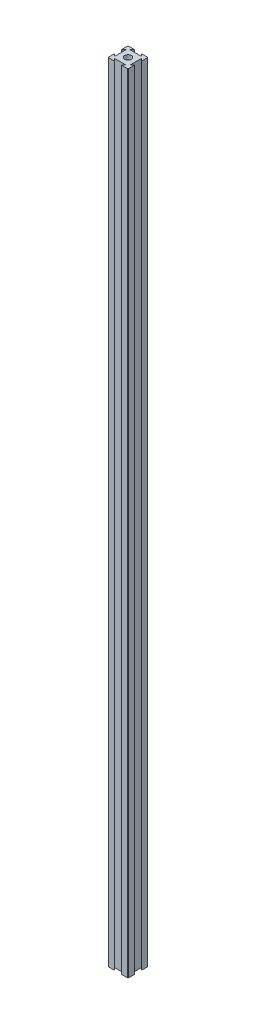
ISO-10303-21;
HEADER;
FILE_DESCRIPTION(('STEP AP214'),'2;1');
FILE_NAME('part.step','',(''),(''),'','','');
FILE_SCHEMA(('AUTOMOTIVE_DESIGN { 1 0 10303 214 1 1 1 1 }'));
ENDSEC;
DATA;
#1=APPLICATION_CONTEXT('core data for automotive mechanical design processes');
#2=APPLICATION_PROTOCOL_DEFINITION('international standard','automotive_design',2000,#1);
#3=PRODUCT_CONTEXT('',#1,'mechanical');
#4=PRODUCT('Part','Part','',(#3));
#5=PRODUCT_RELATED_PRODUCT_CATEGORY('part','',(#4));
#6=PRODUCT_DEFINITION_FORMATION('','',#4);
#7=PRODUCT_DEFINITION_CONTEXT('part definition',#1,'design');
#8=PRODUCT_DEFINITION('design','',#6,#7);
#9=PRODUCT_DEFINITION_SHAPE('','',#8);
#10=(LENGTH_UNIT() NAMED_UNIT(*) SI_UNIT(.MILLI.,.METRE.));
#11=(NAMED_UNIT(*) PLANE_ANGLE_UNIT() SI_UNIT($,.RADIAN.));
#12=(NAMED_UNIT(*) SI_UNIT($,.STERADIAN.) SOLID_ANGLE_UNIT());
#13=UNCERTAINTY_MEASURE_WITH_UNIT(LENGTH_MEASURE(1.E-05),#10,'distance_accuracy_value','');
#14=(GEOMETRIC_REPRESENTATION_CONTEXT(3) GLOBAL_UNCERTAINTY_ASSIGNED_CONTEXT((#13)) GLOBAL_UNIT_ASSIGNED_CONTEXT((#10,
#11,#12)) REPRESENTATION_CONTEXT('',''));
#15=CARTESIAN_POINT('',(0.,0.,0.));
#16=DIRECTION('',(0.,0.,1.));
#17=DIRECTION('',(1.,0.,0.));
#18=AXIS2_PLACEMENT_3D('',#15,#16,#17);
#19=CARTESIAN_POINT('',(16.6666666666667,787.4,-16.6666666666667));
#20=DIRECTION('',(-0.707106781186547,0.,0.707106781186548));
#21=DIRECTION('',(0.707106781186548,0.,0.707106781186547));
#22=AXIS2_PLACEMENT_3D('',#19,#20,#21);
#23=PLANE('',#22);
#24=DIRECTION('',(-0.707106781186548,0.,-0.707106781186547));
#25=VECTOR('',#24,1.);
#26=CARTESIAN_POINT('',(16.6666666666667,0.,-16.6666666666667));
#27=LINE('',#26,#25);
#28=CARTESIAN_POINT('',(20.,0.,-13.3333333333333));
#29=VERTEX_POINT('',#28);
#30=CARTESIAN_POINT('',(17.6183333333333,0.,-15.715));
#31=VERTEX_POINT('',#30);
#32=EDGE_CURVE('E201',#29,#31,#27,.T.);
#33=ORIENTED_EDGE('',*,*,#32,.F.);
#34=DIRECTION('',(0.,-1.,0.));
#35=VECTOR('',#34,1.);
#36=CARTESIAN_POINT('',(20.,787.4,-13.3333333333333));
#37=LINE('',#36,#35);
#38=CARTESIAN_POINT('',(20.,787.4,-13.3333333333333));
#39=VERTEX_POINT('',#38);
#40=EDGE_CURVE('E195',#39,#29,#37,.T.);
#41=ORIENTED_EDGE('',*,*,#40,.F.);
#42=DIRECTION('',(-0.707106781186548,0.,-0.707106781186547));
#43=VECTOR('',#42,1.);
#44=CARTESIAN_POINT('',(16.6666666666667,787.4,-16.6666666666667));
#45=LINE('',#44,#43);
#46=CARTESIAN_POINT('',(17.6183333333333,787.4,-15.715));
#47=VERTEX_POINT('',#46);
#48=EDGE_CURVE('E198',#39,#47,#45,.T.);
#49=ORIENTED_EDGE('',*,*,#48,.T.);
#50=DIRECTION('',(0.,-1.,0.));
#51=VECTOR('',#50,1.);
#52=CARTESIAN_POINT('',(17.6183333333333,787.4,-15.715));
#53=LINE('',#52,#51);
#54=EDGE_CURVE('E269',#47,#31,#53,.T.);
#55=ORIENTED_EDGE('',*,*,#54,.T.);
#56=EDGE_LOOP('',(#33,#41,#49,#55));
#57=FACE_BOUND('',#56,.T.);
#58=ADVANCED_FACE('F35',(#57),#23,.T.);
#59=CARTESIAN_POINT('',(20.,787.4,0.));
#60=DIRECTION('',(-1.,0.,0.));
#61=DIRECTION('',(0.,0.,1.));
#62=AXIS2_PLACEMENT_3D('',#59,#60,#61);
#63=PLANE('',#62);
#64=DIRECTION('',(0.,0.,-1.));
#65=VECTOR('',#64,1.);
#66=CARTESIAN_POINT('',(20.,0.,0.));
#67=LINE('',#66,#65);
#68=CARTESIAN_POINT('',(20.,0.,-19.492));
#69=VERTEX_POINT('',#68);
#70=EDGE_CURVE('E274',#29,#69,#67,.T.);
#71=ORIENTED_EDGE('',*,*,#70,.T.);
#72=DIRECTION('',(0.,-1.,0.));
#73=VECTOR('',#72,1.);
#74=CARTESIAN_POINT('',(20.,787.4,-19.492));
#75=LINE('',#74,#73);
#76=CARTESIAN_POINT('',(20.,787.4,-19.492));
#77=VERTEX_POINT('',#76);
#78=EDGE_CURVE('E212',#69,#77,#75,.F.);
#79=ORIENTED_EDGE('',*,*,#78,.T.);
#80=DIRECTION('',(0.,0.,-1.));
#81=VECTOR('',#80,1.);
#82=CARTESIAN_POINT('',(20.,787.4,0.));
#83=LINE('',#82,#81);
#84=EDGE_CURVE('E209',#39,#77,#83,.T.);
#85=ORIENTED_EDGE('',*,*,#84,.F.);
#86=ORIENTED_EDGE('',*,*,#40,.T.);
#87=EDGE_LOOP('',(#71,#79,#85,#86));
#88=FACE_BOUND('',#87,.T.);
#89=ADVANCED_FACE('F210',(#88),#63,.F.);
#90=CARTESIAN_POINT('',(0.,787.4,-20.));
#91=DIRECTION('',(0.,0.,-1.));
#92=DIRECTION('',(-1.,0.,0.));
#93=AXIS2_PLACEMENT_3D('',#90,#91,#92);
#94=PLANE('',#93);
#95=DIRECTION('',(1.,0.,0.));
#96=VECTOR('',#95,1.);
#97=CARTESIAN_POINT('',(0.,787.4,-20.));
#98=LINE('',#97,#96);
#99=CARTESIAN_POINT('',(13.3333333333333,787.4,-20.));
#100=VERTEX_POINT('',#99);
#101=CARTESIAN_POINT('',(19.492,787.4,-20.));
#102=VERTEX_POINT('',#101);
#103=EDGE_CURVE('E214',#100,#102,#98,.T.);
#104=ORIENTED_EDGE('',*,*,#103,.T.);
#105=DIRECTION('',(0.,-1.,0.));
#106=VECTOR('',#105,1.);
#107=CARTESIAN_POINT('',(19.492,0.,-20.));
#108=LINE('',#107,#106);
#109=CARTESIAN_POINT('',(19.492,0.,-20.));
#110=VERTEX_POINT('',#109);
#111=EDGE_CURVE('E376',#102,#110,#108,.T.);
#112=ORIENTED_EDGE('',*,*,#111,.T.);
#113=DIRECTION('',(1.,0.,0.));
#114=VECTOR('',#113,1.);
#115=CARTESIAN_POINT('',(0.,0.,-20.));
#116=LINE('',#115,#114);
#117=CARTESIAN_POINT('',(13.3333333333333,0.,-20.));
#118=VERTEX_POINT('',#117);
#119=EDGE_CURVE('E276',#118,#110,#116,.T.);
#120=ORIENTED_EDGE('',*,*,#119,.F.);
#121=DIRECTION('',(0.,-1.,0.));
#122=VECTOR('',#121,1.);
#123=CARTESIAN_POINT('',(13.3333333333333,787.4,-20.));
#124=LINE('',#123,#122);
#125=EDGE_CURVE('E206',#100,#118,#124,.T.);
#126=ORIENTED_EDGE('',*,*,#125,.F.);
#127=EDGE_LOOP('',(#104,#112,#120,#126));
#128=FACE_BOUND('',#127,.T.);
#129=ADVANCED_FACE('F408',(#128),#94,.T.);
#130=CARTESIAN_POINT('',(16.6666666666666,787.4,-16.6666666666668));
#131=DIRECTION('',(-0.707106781186544,0.,0.707106781186551));
#132=DIRECTION('',(0.707106781186551,0.,0.707106781186544));
#133=AXIS2_PLACEMENT_3D('',#130,#131,#132);
#134=PLANE('',#133);
#135=DIRECTION('',(-0.707106781186551,0.,-0.707106781186544));
#136=VECTOR('',#135,1.);
#137=CARTESIAN_POINT('',(16.6666666666666,0.,-16.6666666666668));
#138=LINE('',#137,#136);
#139=CARTESIAN_POINT('',(15.715,0.,-17.6183333333334));
#140=VERTEX_POINT('',#139);
#141=EDGE_CURVE('E280',#140,#118,#138,.T.);
#142=ORIENTED_EDGE('',*,*,#141,.F.);
#143=DIRECTION('',(0.,-1.,0.));
#144=VECTOR('',#143,1.);
#145=CARTESIAN_POINT('',(15.715,787.4,-17.6183333333334));
#146=LINE('',#145,#144);
#147=CARTESIAN_POINT('',(15.715,787.4,-17.6183333333334));
#148=VERTEX_POINT('',#147);
#149=EDGE_CURVE('E354',#148,#140,#146,.T.);
#150=ORIENTED_EDGE('',*,*,#149,.F.);
#151=DIRECTION('',(-0.707106781186551,0.,-0.707106781186544));
#152=VECTOR('',#151,1.);
#153=CARTESIAN_POINT('',(16.6666666666666,787.4,-16.6666666666668));
#154=LINE('',#153,#152);
#155=EDGE_CURVE('E230',#148,#100,#154,.T.);
#156=ORIENTED_EDGE('',*,*,#155,.T.);
#157=ORIENTED_EDGE('',*,*,#125,.T.);
#158=EDGE_LOOP('',(#142,#150,#156,#157));
#159=FACE_BOUND('',#158,.T.);
#160=ADVANCED_FACE('F412',(#159),#134,.T.);
#161=CARTESIAN_POINT('',(0.,787.4,-17.6183333333334));
#162=DIRECTION('',(0.,0.,-1.));
#163=DIRECTION('',(-1.,0.,0.));
#164=AXIS2_PLACEMENT_3D('',#161,#162,#163);
#165=PLANE('',#164);
#166=DIRECTION('',(1.,0.,0.));
#167=VECTOR('',#166,1.);
#168=CARTESIAN_POINT('',(0.,0.,-17.6183333333334));
#169=LINE('',#168,#167);
#170=CARTESIAN_POINT('',(4.285,0.,-17.6183333333334));
#171=VERTEX_POINT('',#170);
#172=EDGE_CURVE('E284',#171,#140,#169,.T.);
#173=ORIENTED_EDGE('',*,*,#172,.F.);
#174=DIRECTION('',(0.,-1.,0.));
#175=VECTOR('',#174,1.);
#176=CARTESIAN_POINT('',(4.285,787.4,-17.6183333333334));
#177=LINE('',#176,#175);
#178=CARTESIAN_POINT('',(4.285,787.4,-17.6183333333334));
#179=VERTEX_POINT('',#178);
#180=EDGE_CURVE('E352',#179,#171,#177,.T.);
#181=ORIENTED_EDGE('',*,*,#180,.F.);
#182=DIRECTION('',(1.,0.,0.));
#183=VECTOR('',#182,1.);
#184=CARTESIAN_POINT('',(0.,787.4,-17.6183333333334));
#185=LINE('',#184,#183);
#186=EDGE_CURVE('E234',#179,#148,#185,.T.);
#187=ORIENTED_EDGE('',*,*,#186,.T.);
#188=ORIENTED_EDGE('',*,*,#149,.T.);
#189=EDGE_LOOP('',(#173,#181,#187,#188));
#190=FACE_BOUND('',#189,.T.);
#191=ADVANCED_FACE('F439',(#190),#165,.T.);
#192=CARTESIAN_POINT('',(-6.6666666666667,787.4,-6.66666666666677));
#193=DIRECTION('',(0.707106781186544,0.,0.707106781186551));
#194=DIRECTION('',(0.707106781186551,0.,-0.707106781186544));
#195=AXIS2_PLACEMENT_3D('',#192,#193,#194);
#196=PLANE('',#195);
#197=DIRECTION('',(-0.707106781186551,0.,0.707106781186544));
#198=VECTOR('',#197,1.);
#199=CARTESIAN_POINT('',(-6.6666666666667,0.,-6.66666666666677));
#200=LINE('',#199,#198);
#201=CARTESIAN_POINT('',(6.66666666666666,0.,-20.));
#202=VERTEX_POINT('',#201);
#203=EDGE_CURVE('E287',#202,#171,#200,.T.);
#204=ORIENTED_EDGE('',*,*,#203,.F.);
#205=DIRECTION('',(0.,-1.,0.));
#206=VECTOR('',#205,1.);
#207=CARTESIAN_POINT('',(6.66666666666666,787.4,-20.));
#208=LINE('',#207,#206);
#209=CARTESIAN_POINT('',(6.66666666666666,787.4,-20.));
#210=VERTEX_POINT('',#209);
#211=EDGE_CURVE('E349',#210,#202,#208,.T.);
#212=ORIENTED_EDGE('',*,*,#211,.F.);
#213=DIRECTION('',(-0.707106781186551,0.,0.707106781186544));
#214=VECTOR('',#213,1.);
#215=CARTESIAN_POINT('',(-6.6666666666667,787.4,-6.66666666666677));
#216=LINE('',#215,#214);
#217=EDGE_CURVE('E237',#210,#179,#216,.T.);
#218=ORIENTED_EDGE('',*,*,#217,.T.);
#219=ORIENTED_EDGE('',*,*,#180,.T.);
#220=EDGE_LOOP('',(#204,#212,#218,#219));
#221=FACE_BOUND('',#220,.T.);
#222=ADVANCED_FACE('F442',(#221),#196,.T.);
#223=CARTESIAN_POINT('',(0.508,0.,-20.));
#224=VERTEX_POINT('',#223);
#225=EDGE_CURVE('E281',#224,#202,#116,.T.);
#226=ORIENTED_EDGE('',*,*,#225,.F.);
#227=DIRECTION('',(0.,-1.,0.));
#228=VECTOR('',#227,1.);
#229=CARTESIAN_POINT('',(0.508,787.4,-20.));
#230=LINE('',#229,#228);
#231=CARTESIAN_POINT('',(0.508,787.4,-20.));
#232=VERTEX_POINT('',#231);
#233=EDGE_CURVE('E367',#224,#232,#230,.F.);
#234=ORIENTED_EDGE('',*,*,#233,.T.);
#235=EDGE_CURVE('E231',#232,#210,#98,.T.);
#236=ORIENTED_EDGE('',*,*,#235,.T.);
#237=ORIENTED_EDGE('',*,*,#211,.T.);
#238=EDGE_LOOP('',(#226,#234,#236,#237));
#239=FACE_BOUND('',#238,.T.);
#240=ADVANCED_FACE('F505',(#239),#94,.T.);
#241=CARTESIAN_POINT('',(0.,787.4,0.));
#242=DIRECTION('',(-1.,0.,0.));
#243=DIRECTION('',(0.,0.,1.));
#244=AXIS2_PLACEMENT_3D('',#241,#242,#243);
#245=PLANE('',#244);
#246=DIRECTION('',(0.,0.,-1.));
#247=VECTOR('',#246,1.);
#248=CARTESIAN_POINT('',(0.,787.4,0.));
#249=LINE('',#248,#247);
#250=CARTESIAN_POINT('',(0.,787.4,-13.3333333333333));
#251=VERTEX_POINT('',#250);
#252=CARTESIAN_POINT('',(0.,787.4,-19.492));
#253=VERTEX_POINT('',#252);
#254=EDGE_CURVE('E240',#251,#253,#249,.T.);
#255=ORIENTED_EDGE('',*,*,#254,.T.);
#256=DIRECTION('',(0.,-1.,0.));
#257=VECTOR('',#256,1.);
#258=CARTESIAN_POINT('',(0.,787.4,-19.492));
#259=LINE('',#258,#257);
#260=CARTESIAN_POINT('',(0.,0.,-19.492));
#261=VERTEX_POINT('',#260);
#262=EDGE_CURVE('E205',#253,#261,#259,.T.);
#263=ORIENTED_EDGE('',*,*,#262,.T.);
#264=DIRECTION('',(0.,0.,-1.));
#265=VECTOR('',#264,1.);
#266=CARTESIAN_POINT('',(0.,0.,0.));
#267=LINE('',#266,#265);
#268=CARTESIAN_POINT('',(0.,0.,-13.3333333333333));
#269=VERTEX_POINT('',#268);
#270=EDGE_CURVE('E290',#269,#261,#267,.T.);
#271=ORIENTED_EDGE('',*,*,#270,.F.);
#272=DIRECTION('',(0.,-1.,0.));
#273=VECTOR('',#272,1.);
#274=CARTESIAN_POINT('',(0.,787.4,-13.3333333333333));
#275=LINE('',#274,#273);
#276=EDGE_CURVE('E347',#251,#269,#275,.T.);
#277=ORIENTED_EDGE('',*,*,#276,.F.);
#278=EDGE_LOOP('',(#255,#263,#271,#277));
#279=FACE_BOUND('',#278,.T.);
#280=ADVANCED_FACE('F451',(#279),#245,.T.);
#281=CARTESIAN_POINT('',(-6.66666666666667,787.4,-6.66666666666669));
#282=DIRECTION('',(-0.707106781186547,0.,-0.707106781186548));
#283=DIRECTION('',(-0.707106781186548,0.,0.707106781186547));
#284=AXIS2_PLACEMENT_3D('',#281,#282,#283);
#285=PLANE('',#284);
#286=DIRECTION('',(0.707106781186549,0.,-0.707106781186547));
#287=VECTOR('',#286,1.);
#288=CARTESIAN_POINT('',(-6.66666666666667,0.,-6.66666666666669));
#289=LINE('',#288,#287);
#290=CARTESIAN_POINT('',(2.38166666666667,0.,-15.715));
#291=VERTEX_POINT('',#290);
#292=EDGE_CURVE('E293',#269,#291,#289,.T.);
#293=ORIENTED_EDGE('',*,*,#292,.T.);
#294=DIRECTION('',(0.,-1.,0.));
#295=VECTOR('',#294,1.);
#296=CARTESIAN_POINT('',(2.38166666666667,787.4,-15.715));
#297=LINE('',#296,#295);
#298=CARTESIAN_POINT('',(2.38166666666667,787.4,-15.715));
#299=VERTEX_POINT('',#298);
#300=EDGE_CURVE('E344',#299,#291,#297,.T.);
#301=ORIENTED_EDGE('',*,*,#300,.F.);
#302=DIRECTION('',(0.707106781186549,0.,-0.707106781186547));
#303=VECTOR('',#302,1.);
#304=CARTESIAN_POINT('',(-6.66666666666667,787.4,-6.66666666666669));
#305=LINE('',#304,#303);
#306=EDGE_CURVE('E243',#251,#299,#305,.T.);
#307=ORIENTED_EDGE('',*,*,#306,.F.);
#308=ORIENTED_EDGE('',*,*,#276,.T.);
#309=EDGE_LOOP('',(#293,#301,#307,#308));
#310=FACE_BOUND('',#309,.T.);
#311=ADVANCED_FACE('F456',(#310),#285,.F.);
#312=CARTESIAN_POINT('',(2.38166666666667,787.4,0.));
#313=DIRECTION('',(1.,0.,0.));
#314=DIRECTION('',(0.,0.,-1.));
#315=AXIS2_PLACEMENT_3D('',#312,#313,#314);
#316=PLANE('',#315);
#317=DIRECTION('',(0.,0.,1.));
#318=VECTOR('',#317,1.);
#319=CARTESIAN_POINT('',(2.38166666666667,0.,0.));
#320=LINE('',#319,#318);
#321=CARTESIAN_POINT('',(2.38166666666667,0.,-4.285));
#322=VERTEX_POINT('',#321);
#323=EDGE_CURVE('E297',#291,#322,#320,.T.);
#324=ORIENTED_EDGE('',*,*,#323,.T.);
#325=DIRECTION('',(0.,-1.,0.));
#326=VECTOR('',#325,1.);
#327=CARTESIAN_POINT('',(2.38166666666667,787.4,-4.285));
#328=LINE('',#327,#326);
#329=CARTESIAN_POINT('',(2.38166666666667,787.4,-4.285));
#330=VERTEX_POINT('',#329);
#331=EDGE_CURVE('E341',#330,#322,#328,.T.);
#332=ORIENTED_EDGE('',*,*,#331,.F.);
#333=DIRECTION('',(0.,0.,1.));
#334=VECTOR('',#333,1.);
#335=CARTESIAN_POINT('',(2.38166666666667,787.4,0.));
#336=LINE('',#335,#334);
#337=EDGE_CURVE('E247',#299,#330,#336,.T.);
#338=ORIENTED_EDGE('',*,*,#337,.F.);
#339=ORIENTED_EDGE('',*,*,#300,.T.);
#340=EDGE_LOOP('',(#324,#332,#338,#339));
#341=FACE_BOUND('',#340,.T.);
#342=ADVANCED_FACE('F462',(#341),#316,.F.);
#343=CARTESIAN_POINT('',(3.33333333333333,787.4,-3.33333333333335));
#344=DIRECTION('',(-0.707106781186546,0.,0.707106781186549));
#345=DIRECTION('',(0.707106781186549,0.,0.707106781186546));
#346=AXIS2_PLACEMENT_3D('',#343,#344,#345);
#347=PLANE('',#346);
#348=DIRECTION('',(-0.707106781186549,0.,-0.707106781186546));
#349=VECTOR('',#348,1.);
#350=CARTESIAN_POINT('',(3.33333333333333,0.,-3.33333333333335));
#351=LINE('',#350,#349);
#352=CARTESIAN_POINT('',(0.,0.,-6.66666666666667));
#353=VERTEX_POINT('',#352);
#354=EDGE_CURVE('E300',#322,#353,#351,.T.);
#355=ORIENTED_EDGE('',*,*,#354,.T.);
#356=DIRECTION('',(0.,-1.,0.));
#357=VECTOR('',#356,1.);
#358=CARTESIAN_POINT('',(0.,787.4,-6.66666666666667));
#359=LINE('',#358,#357);
#360=CARTESIAN_POINT('',(0.,787.4,-6.66666666666667));
#361=VERTEX_POINT('',#360);
#362=EDGE_CURVE('E338',#361,#353,#359,.T.);
#363=ORIENTED_EDGE('',*,*,#362,.F.);
#364=DIRECTION('',(-0.707106781186549,0.,-0.707106781186546));
#365=VECTOR('',#364,1.);
#366=CARTESIAN_POINT('',(3.33333333333333,787.4,-3.33333333333335));
#367=LINE('',#366,#365);
#368=EDGE_CURVE('E250',#330,#361,#367,.T.);
#369=ORIENTED_EDGE('',*,*,#368,.F.);
#370=ORIENTED_EDGE('',*,*,#331,.T.);
#371=EDGE_LOOP('',(#355,#363,#369,#370));
#372=FACE_BOUND('',#371,.T.);
#373=ADVANCED_FACE('F464',(#372),#347,.F.);
#374=CARTESIAN_POINT('',(0.,0.,-0.508));
#375=VERTEX_POINT('',#374);
#376=EDGE_CURVE('E294',#375,#353,#267,.T.);
#377=ORIENTED_EDGE('',*,*,#376,.F.);
#378=DIRECTION('',(0.,-1.,0.));
#379=VECTOR('',#378,1.);
#380=CARTESIAN_POINT('',(0.,787.4,-0.508));
#381=LINE('',#380,#379);
#382=CARTESIAN_POINT('',(0.,787.4,-0.508));
#383=VERTEX_POINT('',#382);
#384=EDGE_CURVE('E383',#375,#383,#381,.F.);
#385=ORIENTED_EDGE('',*,*,#384,.T.);
#386=EDGE_CURVE('E244',#383,#361,#249,.T.);
#387=ORIENTED_EDGE('',*,*,#386,.T.);
#388=ORIENTED_EDGE('',*,*,#362,.T.);
#389=EDGE_LOOP('',(#377,#385,#387,#388));
#390=FACE_BOUND('',#389,.T.);
#391=ADVANCED_FACE('F467',(#390),#245,.T.);
#392=CARTESIAN_POINT('',(0.,787.4,0.));
#393=DIRECTION('',(0.,0.,-1.));
#394=DIRECTION('',(-1.,0.,0.));
#395=AXIS2_PLACEMENT_3D('',#392,#393,#394);
#396=PLANE('',#395);
#397=DIRECTION('',(1.,0.,0.));
#398=VECTOR('',#397,1.);
#399=CARTESIAN_POINT('',(0.,787.4,0.));
#400=LINE('',#399,#398);
#401=CARTESIAN_POINT('',(0.508,787.4,0.));
#402=VERTEX_POINT('',#401);
#403=CARTESIAN_POINT('',(6.66666666666667,787.4,0.));
#404=VERTEX_POINT('',#403);
#405=EDGE_CURVE('E253',#402,#404,#400,.T.);
#406=ORIENTED_EDGE('',*,*,#405,.F.);
#407=DIRECTION('',(0.,-1.,0.));
#408=VECTOR('',#407,1.);
#409=CARTESIAN_POINT('',(0.508,0.,0.));
#410=LINE('',#409,#408);
#411=CARTESIAN_POINT('',(0.508,0.,0.));
#412=VERTEX_POINT('',#411);
#413=EDGE_CURVE('E380',#402,#412,#410,.T.);
#414=ORIENTED_EDGE('',*,*,#413,.T.);
#415=DIRECTION('',(1.,0.,0.));
#416=VECTOR('',#415,1.);
#417=CARTESIAN_POINT('',(0.,0.,0.));
#418=LINE('',#417,#416);
#419=CARTESIAN_POINT('',(6.66666666666667,0.,0.));
#420=VERTEX_POINT('',#419);
#421=EDGE_CURVE('E303',#412,#420,#418,.T.);
#422=ORIENTED_EDGE('',*,*,#421,.T.);
#423=DIRECTION('',(0.,-1.,0.));
#424=VECTOR('',#423,1.);
#425=CARTESIAN_POINT('',(6.66666666666667,787.4,0.));
#426=LINE('',#425,#424);
#427=EDGE_CURVE('E335',#404,#420,#426,.T.);
#428=ORIENTED_EDGE('',*,*,#427,.F.);
#429=EDGE_LOOP('',(#406,#414,#422,#428));
#430=FACE_BOUND('',#429,.T.);
#431=ADVANCED_FACE('F474',(#430),#396,.F.);
#432=CARTESIAN_POINT('',(3.3333333333333,787.4,-3.33333333333333));
#433=DIRECTION('',(-0.707106781186544,0.,0.707106781186551));
#434=DIRECTION('',(0.707106781186551,0.,0.707106781186544));
#435=AXIS2_PLACEMENT_3D('',#432,#433,#434);
#436=PLANE('',#435);
#437=DIRECTION('',(-0.707106781186551,0.,-0.707106781186544));
#438=VECTOR('',#437,1.);
#439=CARTESIAN_POINT('',(3.3333333333333,0.,-3.33333333333333));
#440=LINE('',#439,#438);
#441=CARTESIAN_POINT('',(4.285,0.,-2.38166666666664));
#442=VERTEX_POINT('',#441);
#443=EDGE_CURVE('E305',#420,#442,#440,.T.);
#444=ORIENTED_EDGE('',*,*,#443,.T.);
#445=DIRECTION('',(0.,-1.,0.));
#446=VECTOR('',#445,1.);
#447=CARTESIAN_POINT('',(4.285,787.4,-2.38166666666664));
#448=LINE('',#447,#446);
#449=CARTESIAN_POINT('',(4.285,787.4,-2.38166666666664));
#450=VERTEX_POINT('',#449);
#451=EDGE_CURVE('E332',#450,#442,#448,.T.);
#452=ORIENTED_EDGE('',*,*,#451,.F.);
#453=DIRECTION('',(-0.707106781186551,0.,-0.707106781186544));
#454=VECTOR('',#453,1.);
#455=CARTESIAN_POINT('',(3.3333333333333,787.4,-3.33333333333333));
#456=LINE('',#455,#454);
#457=EDGE_CURVE('E255',#404,#450,#456,.T.);
#458=ORIENTED_EDGE('',*,*,#457,.F.);
#459=ORIENTED_EDGE('',*,*,#427,.T.);
#460=EDGE_LOOP('',(#444,#452,#458,#459));
#461=FACE_BOUND('',#460,.T.);
#462=ADVANCED_FACE('F480',(#461),#436,.F.);
#463=CARTESIAN_POINT('',(0.,787.4,-2.38166666666664));
#464=DIRECTION('',(0.,0.,-1.));
#465=DIRECTION('',(-1.,0.,0.));
#466=AXIS2_PLACEMENT_3D('',#463,#464,#465);
#467=PLANE('',#466);
#468=DIRECTION('',(1.,0.,0.));
#469=VECTOR('',#468,1.);
#470=CARTESIAN_POINT('',(0.,0.,-2.38166666666664));
#471=LINE('',#470,#469);
#472=CARTESIAN_POINT('',(15.715,0.,-2.38166666666664));
#473=VERTEX_POINT('',#472);
#474=EDGE_CURVE('E309',#442,#473,#471,.T.);
#475=ORIENTED_EDGE('',*,*,#474,.T.);
#476=DIRECTION('',(0.,-1.,0.));
#477=VECTOR('',#476,1.);
#478=CARTESIAN_POINT('',(15.715,787.4,-2.38166666666664));
#479=LINE('',#478,#477);
#480=CARTESIAN_POINT('',(15.715,787.4,-2.38166666666664));
#481=VERTEX_POINT('',#480);
#482=EDGE_CURVE('E329',#481,#473,#479,.T.);
#483=ORIENTED_EDGE('',*,*,#482,.F.);
#484=DIRECTION('',(1.,0.,0.));
#485=VECTOR('',#484,1.);
#486=CARTESIAN_POINT('',(0.,787.4,-2.38166666666664));
#487=LINE('',#486,#485);
#488=EDGE_CURVE('E259',#450,#481,#487,.T.);
#489=ORIENTED_EDGE('',*,*,#488,.F.);
#490=ORIENTED_EDGE('',*,*,#451,.T.);
#491=EDGE_LOOP('',(#475,#483,#489,#490));
#492=FACE_BOUND('',#491,.T.);
#493=ADVANCED_FACE('F483',(#492),#467,.F.);
#494=CARTESIAN_POINT('',(6.66666666666659,787.4,6.66666666666667));
#495=DIRECTION('',(0.707106781186544,0.,0.707106781186551));
#496=DIRECTION('',(0.707106781186551,0.,-0.707106781186544));
#497=AXIS2_PLACEMENT_3D('',#494,#495,#496);
#498=PLANE('',#497);
#499=DIRECTION('',(-0.707106781186551,0.,0.707106781186544));
#500=VECTOR('',#499,1.);
#501=CARTESIAN_POINT('',(6.66666666666659,0.,6.66666666666667));
#502=LINE('',#501,#500);
#503=CARTESIAN_POINT('',(13.3333333333333,0.,0.));
#504=VERTEX_POINT('',#503);
#505=EDGE_CURVE('E312',#473,#504,#502,.T.);
#506=ORIENTED_EDGE('',*,*,#505,.T.);
#507=DIRECTION('',(0.,-1.,0.));
#508=VECTOR('',#507,1.);
#509=CARTESIAN_POINT('',(13.3333333333333,787.4,0.));
#510=LINE('',#509,#508);
#511=CARTESIAN_POINT('',(13.3333333333333,787.4,0.));
#512=VERTEX_POINT('',#511);
#513=EDGE_CURVE('E326',#512,#504,#510,.T.);
#514=ORIENTED_EDGE('',*,*,#513,.F.);
#515=DIRECTION('',(-0.707106781186551,0.,0.707106781186544));
#516=VECTOR('',#515,1.);
#517=CARTESIAN_POINT('',(6.66666666666659,787.4,6.66666666666667));
#518=LINE('',#517,#516);
#519=EDGE_CURVE('E262',#481,#512,#518,.T.);
#520=ORIENTED_EDGE('',*,*,#519,.F.);
#521=ORIENTED_EDGE('',*,*,#482,.T.);
#522=EDGE_LOOP('',(#506,#514,#520,#521));
#523=FACE_BOUND('',#522,.T.);
#524=ADVANCED_FACE('F485',(#523),#498,.F.);
#525=CARTESIAN_POINT('',(19.492,0.,0.));
#526=VERTEX_POINT('',#525);
#527=EDGE_CURVE('E306',#504,#526,#418,.T.);
#528=ORIENTED_EDGE('',*,*,#527,.T.);
#529=DIRECTION('',(0.,-1.,0.));
#530=VECTOR('',#529,1.);
#531=CARTESIAN_POINT('',(19.492,787.4,0.));
#532=LINE('',#531,#530);
#533=CARTESIAN_POINT('',(19.492,787.4,0.));
#534=VERTEX_POINT('',#533);
#535=EDGE_CURVE('E11',#526,#534,#532,.F.);
#536=ORIENTED_EDGE('',*,*,#535,.T.);
#537=EDGE_CURVE('E256',#512,#534,#400,.T.);
#538=ORIENTED_EDGE('',*,*,#537,.F.);
#539=ORIENTED_EDGE('',*,*,#513,.T.);
#540=EDGE_LOOP('',(#528,#536,#538,#539));
#541=FACE_BOUND('',#540,.T.);
#542=ADVANCED_FACE('F394',(#541),#396,.F.);
#543=CARTESIAN_POINT('',(20.,787.4,-0.508));
#544=VERTEX_POINT('',#543);
#545=CARTESIAN_POINT('',(20.,787.4,-6.66666666666667));
#546=VERTEX_POINT('',#545);
#547=EDGE_CURVE('E216',#544,#546,#83,.T.);
#548=ORIENTED_EDGE('',*,*,#547,.F.);
#549=DIRECTION('',(0.,-1.,0.));
#550=VECTOR('',#549,1.);
#551=CARTESIAN_POINT('',(20.,787.4,-0.508));
#552=LINE('',#551,#550);
#553=CARTESIAN_POINT('',(20.,0.,-0.508));
#554=VERTEX_POINT('',#553);
#555=EDGE_CURVE('E43',#544,#554,#552,.T.);
#556=ORIENTED_EDGE('',*,*,#555,.T.);
#557=CARTESIAN_POINT('',(20.,0.,-6.66666666666667));
#558=VERTEX_POINT('',#557);
#559=EDGE_CURVE('E277',#554,#558,#67,.T.);
#560=ORIENTED_EDGE('',*,*,#559,.T.);
#561=DIRECTION('',(0.,-1.,0.));
#562=VECTOR('',#561,1.);
#563=CARTESIAN_POINT('',(20.,787.4,-6.66666666666667));
#564=LINE('',#563,#562);
#565=EDGE_CURVE('E323',#546,#558,#564,.T.);
#566=ORIENTED_EDGE('',*,*,#565,.F.);
#567=EDGE_LOOP('',(#548,#556,#560,#566));
#568=FACE_BOUND('',#567,.T.);
#569=ADVANCED_FACE('F388',(#568),#63,.F.);
#570=CARTESIAN_POINT('',(6.66666666666663,787.4,6.66666666666666));
#571=DIRECTION('',(-0.707106781186546,0.,-0.707106781186549));
#572=DIRECTION('',(-0.707106781186549,0.,0.707106781186546));
#573=AXIS2_PLACEMENT_3D('',#570,#571,#572);
#574=PLANE('',#573);
#575=DIRECTION('',(0.707106781186549,0.,-0.707106781186546));
#576=VECTOR('',#575,1.);
#577=CARTESIAN_POINT('',(6.66666666666663,0.,6.66666666666666));
#578=LINE('',#577,#576);
#579=CARTESIAN_POINT('',(17.6183333333333,0.,-4.285));
#580=VERTEX_POINT('',#579);
#581=EDGE_CURVE('E315',#580,#558,#578,.T.);
#582=ORIENTED_EDGE('',*,*,#581,.F.);
#583=DIRECTION('',(0.,-1.,0.));
#584=VECTOR('',#583,1.);
#585=CARTESIAN_POINT('',(17.6183333333333,787.4,-4.285));
#586=LINE('',#585,#584);
#587=CARTESIAN_POINT('',(17.6183333333333,787.4,-4.285));
#588=VERTEX_POINT('',#587);
#589=EDGE_CURVE('E321',#588,#580,#586,.T.);
#590=ORIENTED_EDGE('',*,*,#589,.F.);
#591=DIRECTION('',(0.707106781186549,0.,-0.707106781186546));
#592=VECTOR('',#591,1.);
#593=CARTESIAN_POINT('',(6.66666666666663,787.4,6.66666666666666));
#594=LINE('',#593,#592);
#595=EDGE_CURVE('E265',#588,#546,#594,.T.);
#596=ORIENTED_EDGE('',*,*,#595,.T.);
#597=ORIENTED_EDGE('',*,*,#565,.T.);
#598=EDGE_LOOP('',(#582,#590,#596,#597));
#599=FACE_BOUND('',#598,.T.);
#600=ADVANCED_FACE('F418',(#599),#574,.T.);
#601=CARTESIAN_POINT('',(10.,787.4,-10.));
#602=DIRECTION('',(0.,-1.,0.));
#603=DIRECTION('',(0.,0.,-1.));
#604=AXIS2_PLACEMENT_3D('',#601,#602,#603);
#605=CYLINDRICAL_SURFACE('',#604,3.33333333333333);
#606=CARTESIAN_POINT('',(10.,787.4,-10.));
#607=DIRECTION('',(0.,1.,0.));
#608=DIRECTION('',(0.,0.,1.));
#609=AXIS2_PLACEMENT_3D('',#606,#607,#608);
#610=CIRCLE('',#609,3.33333333333333);
#611=CARTESIAN_POINT('',(10.,787.4,-6.66666666666667));
#612=VERTEX_POINT('',#611);
#613=EDGE_CURVE('E222',#612,#612,#610,.T.);
#614=ORIENTED_EDGE('',*,*,#613,.T.);
#615=EDGE_LOOP('',(#614));
#616=FACE_BOUND('',#615,.T.);
#617=CARTESIAN_POINT('',(10.,0.,-10.));
#618=DIRECTION('',(0.,1.,0.));
#619=DIRECTION('',(0.,0.,1.));
#620=AXIS2_PLACEMENT_3D('',#617,#618,#619);
#621=CIRCLE('',#620,3.33333333333333);
#622=CARTESIAN_POINT('',(10.,0.,-6.66666666666667));
#623=VERTEX_POINT('',#622);
#624=EDGE_CURVE('E270',#623,#623,#621,.T.);
#625=ORIENTED_EDGE('',*,*,#624,.F.);
#626=EDGE_LOOP('',(#625));
#627=FACE_BOUND('',#626,.T.);
#628=ADVANCED_FACE('F414',(#616,#627),#605,.F.);
#629=CARTESIAN_POINT('',(17.6183333333333,787.4,0.));
#630=DIRECTION('',(1.,0.,0.));
#631=DIRECTION('',(0.,0.,-1.));
#632=AXIS2_PLACEMENT_3D('',#629,#630,#631);
#633=PLANE('',#632);
#634=DIRECTION('',(0.,0.,1.));
#635=VECTOR('',#634,1.);
#636=CARTESIAN_POINT('',(17.6183333333333,0.,0.));
#637=LINE('',#636,#635);
#638=EDGE_CURVE('E225',#31,#580,#637,.T.);
#639=ORIENTED_EDGE('',*,*,#638,.F.);
#640=ORIENTED_EDGE('',*,*,#54,.F.);
#641=DIRECTION('',(0.,0.,1.));
#642=VECTOR('',#641,1.);
#643=CARTESIAN_POINT('',(17.6183333333333,787.4,0.));
#644=LINE('',#643,#642);
#645=EDGE_CURVE('E221',#47,#588,#644,.T.);
#646=ORIENTED_EDGE('',*,*,#645,.T.);
#647=ORIENTED_EDGE('',*,*,#589,.T.);
#648=EDGE_LOOP('',(#639,#640,#646,#647));
#649=FACE_BOUND('',#648,.T.);
#650=ADVANCED_FACE('F417',(#649),#633,.T.);
#651=CARTESIAN_POINT('',(0.,787.4,0.));
#652=DIRECTION('',(0.,1.,0.));
#653=DIRECTION('',(0.,0.,1.));
#654=AXIS2_PLACEMENT_3D('',#651,#652,#653);
#655=PLANE('',#654);
#656=ORIENTED_EDGE('',*,*,#613,.F.);
#657=EDGE_LOOP('',(#656));
#658=FACE_BOUND('',#657,.T.);
#659=ORIENTED_EDGE('',*,*,#235,.F.);
#660=CARTESIAN_POINT('',(0.508,787.4,-19.492));
#661=DIRECTION('',(0.,1.,0.));
#662=DIRECTION('',(0.,0.,1.));
#663=AXIS2_PLACEMENT_3D('',#660,#661,#662);
#664=CIRCLE('',#663,0.508);
#665=EDGE_CURVE('E374',#232,#253,#664,.T.);
#666=ORIENTED_EDGE('',*,*,#665,.T.);
#667=ORIENTED_EDGE('',*,*,#254,.F.);
#668=ORIENTED_EDGE('',*,*,#306,.T.);
#669=ORIENTED_EDGE('',*,*,#337,.T.);
#670=ORIENTED_EDGE('',*,*,#368,.T.);
#671=ORIENTED_EDGE('',*,*,#386,.F.);
#672=CARTESIAN_POINT('',(0.508,787.4,-0.508));
#673=DIRECTION('',(0.,1.,0.));
#674=DIRECTION('',(0.,0.,1.));
#675=AXIS2_PLACEMENT_3D('',#672,#673,#674);
#676=CIRCLE('',#675,0.508);
#677=EDGE_CURVE('E370',#383,#402,#676,.T.);
#678=ORIENTED_EDGE('',*,*,#677,.T.);
#679=ORIENTED_EDGE('',*,*,#405,.T.);
#680=ORIENTED_EDGE('',*,*,#457,.T.);
#681=ORIENTED_EDGE('',*,*,#488,.T.);
#682=ORIENTED_EDGE('',*,*,#519,.T.);
#683=ORIENTED_EDGE('',*,*,#537,.T.);
#684=CARTESIAN_POINT('',(19.492,787.4,-0.508));
#685=DIRECTION('',(0.,1.,0.));
#686=DIRECTION('',(0.,0.,1.));
#687=AXIS2_PLACEMENT_3D('',#684,#685,#686);
#688=CIRCLE('',#687,0.508);
#689=EDGE_CURVE('E50',#534,#544,#688,.T.);
#690=ORIENTED_EDGE('',*,*,#689,.T.);
#691=ORIENTED_EDGE('',*,*,#547,.T.);
#692=ORIENTED_EDGE('',*,*,#595,.F.);
#693=ORIENTED_EDGE('',*,*,#645,.F.);
#694=ORIENTED_EDGE('',*,*,#48,.F.);
#695=ORIENTED_EDGE('',*,*,#84,.T.);
#696=CARTESIAN_POINT('',(19.492,787.4,-19.492));
#697=DIRECTION('',(0.,1.,0.));
#698=DIRECTION('',(0.,0.,1.));
#699=AXIS2_PLACEMENT_3D('',#696,#697,#698);
#700=CIRCLE('',#699,0.508);
#701=EDGE_CURVE('E372',#77,#102,#700,.T.);
#702=ORIENTED_EDGE('',*,*,#701,.T.);
#703=ORIENTED_EDGE('',*,*,#103,.F.);
#704=ORIENTED_EDGE('',*,*,#155,.F.);
#705=ORIENTED_EDGE('',*,*,#186,.F.);
#706=ORIENTED_EDGE('',*,*,#217,.F.);
#707=EDGE_LOOP('',(#659,#666,#667,#668,#669,#670,#671,#678,#679,#680,#681,#682,#683,#690,#691,
#692,#693,#694,#695,#702,#703,#704,#705,#706));
#708=FACE_BOUND('',#707,.T.);
#709=ADVANCED_FACE('F218',(#658,#708),#655,.T.);
#710=CARTESIAN_POINT('',(0.,0.,0.));
#711=DIRECTION('',(0.,1.,0.));
#712=DIRECTION('',(0.,0.,1.));
#713=AXIS2_PLACEMENT_3D('',#710,#711,#712);
#714=PLANE('',#713);
#715=ORIENTED_EDGE('',*,*,#624,.T.);
#716=EDGE_LOOP('',(#715));
#717=FACE_BOUND('',#716,.T.);
#718=ORIENTED_EDGE('',*,*,#270,.T.);
#719=CARTESIAN_POINT('',(0.508,0.,-19.492));
#720=DIRECTION('',(0.,1.,0.));
#721=DIRECTION('',(0.,0.,1.));
#722=AXIS2_PLACEMENT_3D('',#719,#720,#721);
#723=CIRCLE('',#722,0.508);
#724=EDGE_CURVE('E365',#261,#224,#723,.F.);
#725=ORIENTED_EDGE('',*,*,#724,.T.);
#726=ORIENTED_EDGE('',*,*,#225,.T.);
#727=ORIENTED_EDGE('',*,*,#203,.T.);
#728=ORIENTED_EDGE('',*,*,#172,.T.);
#729=ORIENTED_EDGE('',*,*,#141,.T.);
#730=ORIENTED_EDGE('',*,*,#119,.T.);
#731=CARTESIAN_POINT('',(19.492,0.,-19.492));
#732=DIRECTION('',(0.,1.,0.));
#733=DIRECTION('',(0.,0.,1.));
#734=AXIS2_PLACEMENT_3D('',#731,#732,#733);
#735=CIRCLE('',#734,0.508);
#736=EDGE_CURVE('E363',#110,#69,#735,.F.);
#737=ORIENTED_EDGE('',*,*,#736,.T.);
#738=ORIENTED_EDGE('',*,*,#70,.F.);
#739=ORIENTED_EDGE('',*,*,#32,.T.);
#740=ORIENTED_EDGE('',*,*,#638,.T.);
#741=ORIENTED_EDGE('',*,*,#581,.T.);
#742=ORIENTED_EDGE('',*,*,#559,.F.);
#743=CARTESIAN_POINT('',(19.492,0.,-0.508));
#744=DIRECTION('',(0.,1.,0.));
#745=DIRECTION('',(0.,0.,1.));
#746=AXIS2_PLACEMENT_3D('',#743,#744,#745);
#747=CIRCLE('',#746,0.508);
#748=EDGE_CURVE('E359',#554,#526,#747,.F.);
#749=ORIENTED_EDGE('',*,*,#748,.T.);
#750=ORIENTED_EDGE('',*,*,#527,.F.);
#751=ORIENTED_EDGE('',*,*,#505,.F.);
#752=ORIENTED_EDGE('',*,*,#474,.F.);
#753=ORIENTED_EDGE('',*,*,#443,.F.);
#754=ORIENTED_EDGE('',*,*,#421,.F.);
#755=CARTESIAN_POINT('',(0.508,0.,-0.508));
#756=DIRECTION('',(0.,1.,0.));
#757=DIRECTION('',(0.,0.,1.));
#758=AXIS2_PLACEMENT_3D('',#755,#756,#757);
#759=CIRCLE('',#758,0.508);
#760=EDGE_CURVE('E361',#412,#375,#759,.F.);
#761=ORIENTED_EDGE('',*,*,#760,.T.);
#762=ORIENTED_EDGE('',*,*,#376,.T.);
#763=ORIENTED_EDGE('',*,*,#354,.F.);
#764=ORIENTED_EDGE('',*,*,#323,.F.);
#765=ORIENTED_EDGE('',*,*,#292,.F.);
#766=EDGE_LOOP('',(#718,#725,#726,#727,#728,#729,#730,#737,#738,#739,#740,#741,#742,#749,#750,
#751,#752,#753,#754,#761,#762,#763,#764,#765));
#767=FACE_BOUND('',#766,.T.);
#768=ADVANCED_FACE('F392',(#717,#767),#714,.F.);
#769=CARTESIAN_POINT('',(0.508,787.4,-19.492));
#770=DIRECTION('',(0.,-1.,0.));
#771=DIRECTION('',(0.,0.,-1.));
#772=AXIS2_PLACEMENT_3D('',#769,#770,#771);
#773=CYLINDRICAL_SURFACE('',#772,0.508);
#774=ORIENTED_EDGE('',*,*,#665,.F.);
#775=ORIENTED_EDGE('',*,*,#233,.F.);
#776=ORIENTED_EDGE('',*,*,#724,.F.);
#777=ORIENTED_EDGE('',*,*,#262,.F.);
#778=EDGE_LOOP('',(#774,#775,#776,#777));
#779=FACE_BOUND('',#778,.T.);
#780=ADVANCED_FACE('F420',(#779),#773,.T.);
#781=CARTESIAN_POINT('',(19.492,787.4,-19.492));
#782=DIRECTION('',(0.,1.,0.));
#783=DIRECTION('',(0.,0.,1.));
#784=AXIS2_PLACEMENT_3D('',#781,#782,#783);
#785=CYLINDRICAL_SURFACE('',#784,0.508);
#786=ORIENTED_EDGE('',*,*,#701,.F.);
#787=ORIENTED_EDGE('',*,*,#78,.F.);
#788=ORIENTED_EDGE('',*,*,#736,.F.);
#789=ORIENTED_EDGE('',*,*,#111,.F.);
#790=EDGE_LOOP('',(#786,#787,#788,#789));
#791=FACE_BOUND('',#790,.T.);
#792=ADVANCED_FACE('F401',(#791),#785,.T.);
#793=CARTESIAN_POINT('',(0.508,787.4,-0.508));
#794=DIRECTION('',(0.,1.,0.));
#795=DIRECTION('',(0.,0.,1.));
#796=AXIS2_PLACEMENT_3D('',#793,#794,#795);
#797=CYLINDRICAL_SURFACE('',#796,0.508);
#798=ORIENTED_EDGE('',*,*,#677,.F.);
#799=ORIENTED_EDGE('',*,*,#384,.F.);
#800=ORIENTED_EDGE('',*,*,#760,.F.);
#801=ORIENTED_EDGE('',*,*,#413,.F.);
#802=EDGE_LOOP('',(#798,#799,#800,#801));
#803=FACE_BOUND('',#802,.T.);
#804=ADVANCED_FACE('F397',(#803),#797,.T.);
#805=CARTESIAN_POINT('',(19.492,787.4,-0.508));
#806=DIRECTION('',(0.,-1.,0.));
#807=DIRECTION('',(0.,0.,-1.));
#808=AXIS2_PLACEMENT_3D('',#805,#806,#807);
#809=CYLINDRICAL_SURFACE('',#808,0.508);
#810=ORIENTED_EDGE('',*,*,#689,.F.);
#811=ORIENTED_EDGE('',*,*,#535,.F.);
#812=ORIENTED_EDGE('',*,*,#748,.F.);
#813=ORIENTED_EDGE('',*,*,#555,.F.);
#814=EDGE_LOOP('',(#810,#811,#812,#813));
#815=FACE_BOUND('',#814,.T.);
#816=ADVANCED_FACE('F37',(#815),#809,.T.);
#817=CLOSED_SHELL('',(#58,#89,#129,#160,#191,#222,#240,#280,#311,#342,#373,#391,#431,#462,#493,
#524,#542,#569,#600,#628,#650,#709,#768,#780,#792,#804,#816));
#818=MANIFOLD_SOLID_BREP('B2',#817);
#819=ADVANCED_BREP_SHAPE_REPRESENTATION('',(#18,#818),#14);
#820=SHAPE_DEFINITION_REPRESENTATION(#9,#819);
ENDSEC;
END-ISO-10303-21;
